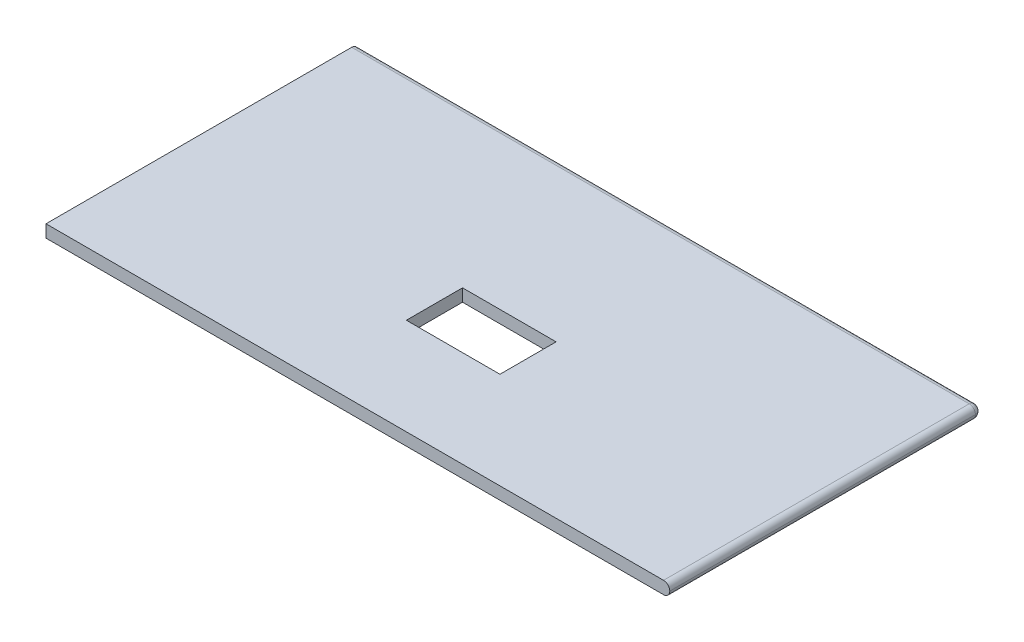
ISO-10303-21;
HEADER;
FILE_DESCRIPTION(('STEP AP214'),'2;1');
FILE_NAME('part.step','',(''),(''),'','','');
FILE_SCHEMA(('AUTOMOTIVE_DESIGN { 1 0 10303 214 1 1 1 1 }'));
ENDSEC;
DATA;
#1=APPLICATION_CONTEXT('core data for automotive mechanical design processes');
#2=APPLICATION_PROTOCOL_DEFINITION('international standard','automotive_design',2000,#1);
#3=PRODUCT_CONTEXT('',#1,'mechanical');
#4=PRODUCT('Part','Part','',(#3));
#5=PRODUCT_RELATED_PRODUCT_CATEGORY('part','',(#4));
#6=PRODUCT_DEFINITION_FORMATION('','',#4);
#7=PRODUCT_DEFINITION_CONTEXT('part definition',#1,'design');
#8=PRODUCT_DEFINITION('design','',#6,#7);
#9=PRODUCT_DEFINITION_SHAPE('','',#8);
#10=(LENGTH_UNIT() NAMED_UNIT(*) SI_UNIT(.MILLI.,.METRE.));
#11=(NAMED_UNIT(*) PLANE_ANGLE_UNIT() SI_UNIT($,.RADIAN.));
#12=(NAMED_UNIT(*) SI_UNIT($,.STERADIAN.) SOLID_ANGLE_UNIT());
#13=UNCERTAINTY_MEASURE_WITH_UNIT(LENGTH_MEASURE(1.E-05),#10,'distance_accuracy_value','');
#14=(GEOMETRIC_REPRESENTATION_CONTEXT(3) GLOBAL_UNCERTAINTY_ASSIGNED_CONTEXT((#13)) GLOBAL_UNIT_ASSIGNED_CONTEXT((#10,
#11,#12)) REPRESENTATION_CONTEXT('',''));
#15=CARTESIAN_POINT('',(0.,0.,0.));
#16=DIRECTION('',(0.,0.,1.));
#17=DIRECTION('',(1.,0.,0.));
#18=AXIS2_PLACEMENT_3D('',#15,#16,#17);
#19=CARTESIAN_POINT('',(-50.,2.,25.));
#20=DIRECTION('',(1.,0.,0.));
#21=DIRECTION('',(0.,0.,-1.));
#22=AXIS2_PLACEMENT_3D('',#19,#20,#21);
#23=PLANE('',#22);
#24=CARTESIAN_POINT('',(-50.,1.,-24.));
#25=DIRECTION('',(1.,0.,0.));
#26=DIRECTION('',(0.,0.,-1.));
#27=AXIS2_PLACEMENT_3D('',#24,#25,#26);
#28=CIRCLE('',#27,1.);
#29=CARTESIAN_POINT('',(-50.,2.,-24.));
#30=VERTEX_POINT('',#29);
#31=CARTESIAN_POINT('',(-50.,1.,-25.));
#32=VERTEX_POINT('',#31);
#33=EDGE_CURVE('E173',#30,#32,#28,.F.);
#34=ORIENTED_EDGE('',*,*,#33,.T.);
#35=CARTESIAN_POINT('',(-50.,1.,-24.));
#36=DIRECTION('',(1.,0.,0.));
#37=DIRECTION('',(0.,0.,-1.));
#38=AXIS2_PLACEMENT_3D('',#35,#36,#37);
#39=CIRCLE('',#38,1.);
#40=CARTESIAN_POINT('',(-50.,0.,-24.));
#41=VERTEX_POINT('',#40);
#42=EDGE_CURVE('E176',#32,#41,#39,.F.);
#43=ORIENTED_EDGE('',*,*,#42,.T.);
#44=DIRECTION('',(0.,0.,1.));
#45=VECTOR('',#44,1.);
#46=CARTESIAN_POINT('',(-50.,0.,25.));
#47=LINE('',#46,#45);
#48=CARTESIAN_POINT('',(-50.,0.,25.));
#49=VERTEX_POINT('',#48);
#50=EDGE_CURVE('E163',#41,#49,#47,.T.);
#51=ORIENTED_EDGE('',*,*,#50,.T.);
#52=DIRECTION('',(0.,-1.,0.));
#53=VECTOR('',#52,1.);
#54=CARTESIAN_POINT('',(-50.,2.,25.));
#55=LINE('',#54,#53);
#56=CARTESIAN_POINT('',(-50.,2.,25.));
#57=VERTEX_POINT('',#56);
#58=EDGE_CURVE('E162',#57,#49,#55,.T.);
#59=ORIENTED_EDGE('',*,*,#58,.F.);
#60=DIRECTION('',(0.,0.,1.));
#61=VECTOR('',#60,1.);
#62=CARTESIAN_POINT('',(-50.,2.,25.));
#63=LINE('',#62,#61);
#64=EDGE_CURVE('E154',#30,#57,#63,.T.);
#65=ORIENTED_EDGE('',*,*,#64,.F.);
#66=EDGE_LOOP('',(#34,#43,#51,#59,#65));
#67=FACE_BOUND('',#66,.T.);
#68=ADVANCED_FACE('F40',(#67),#23,.F.);
#69=CARTESIAN_POINT('',(50.,2.,25.));
#70=DIRECTION('',(0.,0.,-1.));
#71=DIRECTION('',(-1.,0.,0.));
#72=AXIS2_PLACEMENT_3D('',#69,#70,#71);
#73=PLANE('',#72);
#74=DIRECTION('',(1.,0.,0.));
#75=VECTOR('',#74,1.);
#76=CARTESIAN_POINT('',(50.,0.,25.));
#77=LINE('',#76,#75);
#78=CARTESIAN_POINT('',(49.,0.,25.));
#79=VERTEX_POINT('',#78);
#80=EDGE_CURVE('E158',#49,#79,#77,.T.);
#81=ORIENTED_EDGE('',*,*,#80,.T.);
#82=CARTESIAN_POINT('',(49.,1.,25.));
#83=DIRECTION('',(0.,0.,-1.));
#84=DIRECTION('',(-1.,0.,0.));
#85=AXIS2_PLACEMENT_3D('',#82,#83,#84);
#86=CIRCLE('',#85,1.);
#87=CARTESIAN_POINT('',(50.,1.,25.));
#88=VERTEX_POINT('',#87);
#89=EDGE_CURVE('E203',#79,#88,#86,.F.);
#90=ORIENTED_EDGE('',*,*,#89,.T.);
#91=CARTESIAN_POINT('',(49.,1.,25.));
#92=DIRECTION('',(0.,0.,-1.));
#93=DIRECTION('',(-1.,0.,0.));
#94=AXIS2_PLACEMENT_3D('',#91,#92,#93);
#95=CIRCLE('',#94,1.);
#96=CARTESIAN_POINT('',(49.,2.,25.));
#97=VERTEX_POINT('',#96);
#98=EDGE_CURVE('E200',#88,#97,#95,.F.);
#99=ORIENTED_EDGE('',*,*,#98,.T.);
#100=DIRECTION('',(1.,0.,0.));
#101=VECTOR('',#100,1.);
#102=CARTESIAN_POINT('',(50.,2.,25.));
#103=LINE('',#102,#101);
#104=EDGE_CURVE('E157',#57,#97,#103,.T.);
#105=ORIENTED_EDGE('',*,*,#104,.F.);
#106=ORIENTED_EDGE('',*,*,#58,.T.);
#107=EDGE_LOOP('',(#81,#90,#99,#105,#106));
#108=FACE_BOUND('',#107,.T.);
#109=ADVANCED_FACE('F249',(#108),#73,.F.);
#110=CARTESIAN_POINT('',(0.,2.,0.));
#111=DIRECTION('',(0.,1.,0.));
#112=DIRECTION('',(0.,0.,1.));
#113=AXIS2_PLACEMENT_3D('',#110,#111,#112);
#114=PLANE('',#113);
#115=DIRECTION('',(0.,0.,-1.));
#116=VECTOR('',#115,1.);
#117=CARTESIAN_POINT('',(7.27907810343117,2.,0.505960214324788));
#118=LINE('',#117,#116);
#119=CARTESIAN_POINT('',(7.27907810343118,2.,9.50596021432479));
#120=VERTEX_POINT('',#119);
#121=CARTESIAN_POINT('',(7.27907810343117,2.,0.505960214324788));
#122=VERTEX_POINT('',#121);
#123=EDGE_CURVE('E56',#120,#122,#118,.T.);
#124=ORIENTED_EDGE('',*,*,#123,.F.);
#125=DIRECTION('',(1.,0.,0.));
#126=VECTOR('',#125,1.);
#127=CARTESIAN_POINT('',(-7.72092189656882,2.,9.50596021432479));
#128=LINE('',#127,#126);
#129=CARTESIAN_POINT('',(-7.72092189656882,2.,9.50596021432479));
#130=VERTEX_POINT('',#129);
#131=EDGE_CURVE('E139',#130,#120,#128,.T.);
#132=ORIENTED_EDGE('',*,*,#131,.F.);
#133=DIRECTION('',(0.,0.,1.));
#134=VECTOR('',#133,1.);
#135=CARTESIAN_POINT('',(-7.72092189656883,2.,0.50596021432479));
#136=LINE('',#135,#134);
#137=CARTESIAN_POINT('',(-7.72092189656883,2.,0.50596021432479));
#138=VERTEX_POINT('',#137);
#139=EDGE_CURVE('E121',#138,#130,#136,.T.);
#140=ORIENTED_EDGE('',*,*,#139,.F.);
#141=DIRECTION('',(-1.,0.,0.));
#142=VECTOR('',#141,1.);
#143=CARTESIAN_POINT('',(-7.72092189656883,2.,0.50596021432479));
#144=LINE('',#143,#142);
#145=EDGE_CURVE('E131',#122,#138,#144,.T.);
#146=ORIENTED_EDGE('',*,*,#145,.F.);
#147=EDGE_LOOP('',(#124,#132,#140,#146));
#148=FACE_BOUND('',#147,.T.);
#149=ORIENTED_EDGE('',*,*,#104,.T.);
#150=DIRECTION('',(0.,0.,-1.));
#151=VECTOR('',#150,1.);
#152=CARTESIAN_POINT('',(49.,2.,-24.));
#153=LINE('',#152,#151);
#154=CARTESIAN_POINT('',(49.,2.,-24.));
#155=VERTEX_POINT('',#154);
#156=EDGE_CURVE('E206',#97,#155,#153,.T.);
#157=ORIENTED_EDGE('',*,*,#156,.T.);
#158=DIRECTION('',(-1.,0.,0.));
#159=VECTOR('',#158,1.);
#160=CARTESIAN_POINT('',(-50.,2.,-24.));
#161=LINE('',#160,#159);
#162=EDGE_CURVE('E183',#155,#30,#161,.T.);
#163=ORIENTED_EDGE('',*,*,#162,.T.);
#164=ORIENTED_EDGE('',*,*,#64,.T.);
#165=EDGE_LOOP('',(#149,#157,#163,#164));
#166=FACE_BOUND('',#165,.T.);
#167=ADVANCED_FACE('F136',(#148,#166),#114,.T.);
#168=CARTESIAN_POINT('',(0.,0.,0.));
#169=DIRECTION('',(0.,1.,0.));
#170=DIRECTION('',(0.,0.,1.));
#171=AXIS2_PLACEMENT_3D('',#168,#169,#170);
#172=PLANE('',#171);
#173=DIRECTION('',(1.,0.,0.));
#174=VECTOR('',#173,1.);
#175=CARTESIAN_POINT('',(0.,0.,9.50596021432479));
#176=LINE('',#175,#174);
#177=CARTESIAN_POINT('',(-7.72092189656882,0.,9.50596021432479));
#178=VERTEX_POINT('',#177);
#179=CARTESIAN_POINT('',(7.27907810343118,0.,9.50596021432479));
#180=VERTEX_POINT('',#179);
#181=EDGE_CURVE('E49',#178,#180,#176,.T.);
#182=ORIENTED_EDGE('',*,*,#181,.T.);
#183=DIRECTION('',(0.,0.,-1.));
#184=VECTOR('',#183,1.);
#185=CARTESIAN_POINT('',(7.27907810343117,0.,0.));
#186=LINE('',#185,#184);
#187=CARTESIAN_POINT('',(7.27907810343117,0.,0.505960214324788));
#188=VERTEX_POINT('',#187);
#189=EDGE_CURVE('E11',#180,#188,#186,.T.);
#190=ORIENTED_EDGE('',*,*,#189,.T.);
#191=DIRECTION('',(-1.,0.,0.));
#192=VECTOR('',#191,1.);
#193=CARTESIAN_POINT('',(0.,0.,0.505960214324789));
#194=LINE('',#193,#192);
#195=CARTESIAN_POINT('',(-7.72092189656883,0.,0.50596021432479));
#196=VERTEX_POINT('',#195);
#197=EDGE_CURVE('E209',#188,#196,#194,.T.);
#198=ORIENTED_EDGE('',*,*,#197,.T.);
#199=DIRECTION('',(0.,0.,1.));
#200=VECTOR('',#199,1.);
#201=CARTESIAN_POINT('',(-7.72092189656883,0.,0.));
#202=LINE('',#201,#200);
#203=EDGE_CURVE('E124',#196,#178,#202,.T.);
#204=ORIENTED_EDGE('',*,*,#203,.T.);
#205=EDGE_LOOP('',(#182,#190,#198,#204));
#206=FACE_BOUND('',#205,.T.);
#207=DIRECTION('',(-1.,0.,0.));
#208=VECTOR('',#207,1.);
#209=CARTESIAN_POINT('',(0.,0.,-24.));
#210=LINE('',#209,#208);
#211=CARTESIAN_POINT('',(49.,0.,-24.));
#212=VERTEX_POINT('',#211);
#213=EDGE_CURVE('E179',#41,#212,#210,.F.);
#214=ORIENTED_EDGE('',*,*,#213,.T.);
#215=DIRECTION('',(0.,0.,-1.));
#216=VECTOR('',#215,1.);
#217=CARTESIAN_POINT('',(49.,0.,0.));
#218=LINE('',#217,#216);
#219=EDGE_CURVE('E197',#212,#79,#218,.F.);
#220=ORIENTED_EDGE('',*,*,#219,.T.);
#221=ORIENTED_EDGE('',*,*,#80,.F.);
#222=ORIENTED_EDGE('',*,*,#50,.F.);
#223=EDGE_LOOP('',(#214,#220,#221,#222));
#224=FACE_BOUND('',#223,.T.);
#225=ADVANCED_FACE('F229',(#206,#224),#172,.F.);
#226=CARTESIAN_POINT('',(0.,1.,-24.));
#227=DIRECTION('',(1.,0.,0.));
#228=DIRECTION('',(0.,0.,-1.));
#229=AXIS2_PLACEMENT_3D('',#226,#227,#228);
#230=CYLINDRICAL_SURFACE('',#229,1.);
#231=ORIENTED_EDGE('',*,*,#162,.F.);
#232=CARTESIAN_POINT('',(49.,1.,-24.));
#233=DIRECTION('',(1.,0.,0.));
#234=DIRECTION('',(0.,0.,-1.));
#235=AXIS2_PLACEMENT_3D('',#232,#233,#234);
#236=CIRCLE('',#235,1.);
#237=CARTESIAN_POINT('',(49.,1.,-25.));
#238=VERTEX_POINT('',#237);
#239=EDGE_CURVE('E194',#155,#238,#236,.F.);
#240=ORIENTED_EDGE('',*,*,#239,.T.);
#241=DIRECTION('',(-1.,0.,0.));
#242=VECTOR('',#241,1.);
#243=CARTESIAN_POINT('',(50.,1.,-25.));
#244=LINE('',#243,#242);
#245=EDGE_CURVE('E166',#32,#238,#244,.F.);
#246=ORIENTED_EDGE('',*,*,#245,.F.);
#247=ORIENTED_EDGE('',*,*,#33,.F.);
#248=EDGE_LOOP('',(#231,#240,#246,#247));
#249=FACE_BOUND('',#248,.T.);
#250=ADVANCED_FACE('F262',(#249),#230,.T.);
#251=CARTESIAN_POINT('',(50.,1.,-24.));
#252=DIRECTION('',(-1.,0.,0.));
#253=DIRECTION('',(0.,0.,1.));
#254=AXIS2_PLACEMENT_3D('',#251,#252,#253);
#255=CYLINDRICAL_SURFACE('',#254,1.);
#256=ORIENTED_EDGE('',*,*,#245,.T.);
#257=CARTESIAN_POINT('',(49.,1.,-24.));
#258=DIRECTION('',(-1.,0.,0.));
#259=DIRECTION('',(0.,0.,1.));
#260=AXIS2_PLACEMENT_3D('',#257,#258,#259);
#261=CIRCLE('',#260,1.);
#262=EDGE_CURVE('E186',#238,#212,#261,.T.);
#263=ORIENTED_EDGE('',*,*,#262,.T.);
#264=ORIENTED_EDGE('',*,*,#213,.F.);
#265=ORIENTED_EDGE('',*,*,#42,.F.);
#266=EDGE_LOOP('',(#256,#263,#264,#265));
#267=FACE_BOUND('',#266,.T.);
#268=ADVANCED_FACE('F259',(#267),#255,.T.);
#269=CARTESIAN_POINT('',(49.,1.,0.));
#270=DIRECTION('',(0.,0.,1.));
#271=DIRECTION('',(1.,0.,0.));
#272=AXIS2_PLACEMENT_3D('',#269,#270,#271);
#273=CYLINDRICAL_SURFACE('',#272,1.);
#274=ORIENTED_EDGE('',*,*,#156,.F.);
#275=ORIENTED_EDGE('',*,*,#98,.F.);
#276=DIRECTION('',(0.,0.,-1.));
#277=VECTOR('',#276,1.);
#278=CARTESIAN_POINT('',(50.,1.,25.));
#279=LINE('',#278,#277);
#280=CARTESIAN_POINT('',(50.,1.,-24.));
#281=VERTEX_POINT('',#280);
#282=EDGE_CURVE('E190',#281,#88,#279,.F.);
#283=ORIENTED_EDGE('',*,*,#282,.F.);
#284=CARTESIAN_POINT('',(49.,1.,-24.));
#285=DIRECTION('',(0.,0.,-1.));
#286=DIRECTION('',(-1.,0.,0.));
#287=AXIS2_PLACEMENT_3D('',#284,#285,#286);
#288=CIRCLE('',#287,1.);
#289=EDGE_CURVE('E216',#155,#281,#288,.T.);
#290=ORIENTED_EDGE('',*,*,#289,.F.);
#291=EDGE_LOOP('',(#274,#275,#283,#290));
#292=FACE_BOUND('',#291,.T.);
#293=ADVANCED_FACE('F42',(#292),#273,.T.);
#294=CARTESIAN_POINT('',(49.,1.,25.));
#295=DIRECTION('',(0.,0.,-1.));
#296=DIRECTION('',(-1.,0.,0.));
#297=AXIS2_PLACEMENT_3D('',#294,#295,#296);
#298=CYLINDRICAL_SURFACE('',#297,1.);
#299=ORIENTED_EDGE('',*,*,#89,.F.);
#300=ORIENTED_EDGE('',*,*,#219,.F.);
#301=CARTESIAN_POINT('',(49.,1.,-24.));
#302=DIRECTION('',(0.,0.,-1.));
#303=DIRECTION('',(-1.,0.,0.));
#304=AXIS2_PLACEMENT_3D('',#301,#302,#303);
#305=CIRCLE('',#304,1.);
#306=EDGE_CURVE('E213',#281,#212,#305,.T.);
#307=ORIENTED_EDGE('',*,*,#306,.F.);
#308=ORIENTED_EDGE('',*,*,#282,.T.);
#309=EDGE_LOOP('',(#299,#300,#307,#308));
#310=FACE_BOUND('',#309,.T.);
#311=ADVANCED_FACE('F268',(#310),#298,.T.);
#312=CARTESIAN_POINT('',(49.,1.,-24.));
#313=DIRECTION('',(-1.,0.,0.));
#314=DIRECTION('',(0.,0.,1.));
#315=AXIS2_PLACEMENT_3D('',#312,#313,#314);
#316=SPHERICAL_SURFACE('',#315,1.);
#317=ORIENTED_EDGE('',*,*,#239,.F.);
#318=ORIENTED_EDGE('',*,*,#289,.T.);
#319=CARTESIAN_POINT('',(49.,1.,-24.));
#320=DIRECTION('',(0.,-1.,0.));
#321=DIRECTION('',(0.,0.,-1.));
#322=AXIS2_PLACEMENT_3D('',#319,#320,#321);
#323=CIRCLE('',#322,1.);
#324=EDGE_CURVE('E149',#238,#281,#323,.T.);
#325=ORIENTED_EDGE('',*,*,#324,.F.);
#326=EDGE_LOOP('',(#317,#318,#325));
#327=FACE_BOUND('',#326,.T.);
#328=ADVANCED_FACE('F243',(#327),#316,.T.);
#329=CARTESIAN_POINT('',(49.,1.,-24.));
#330=DIRECTION('',(-1.,0.,0.));
#331=DIRECTION('',(0.,0.,1.));
#332=AXIS2_PLACEMENT_3D('',#329,#330,#331);
#333=SPHERICAL_SURFACE('',#332,1.);
#334=ORIENTED_EDGE('',*,*,#306,.T.);
#335=ORIENTED_EDGE('',*,*,#262,.F.);
#336=ORIENTED_EDGE('',*,*,#324,.T.);
#337=EDGE_LOOP('',(#334,#335,#336));
#338=FACE_BOUND('',#337,.T.);
#339=ADVANCED_FACE('F236',(#338),#333,.T.);
#340=CARTESIAN_POINT('',(7.27907810343117,-8.,0.505960214324788));
#341=DIRECTION('',(1.,0.,0.));
#342=DIRECTION('',(0.,0.,-1.));
#343=AXIS2_PLACEMENT_3D('',#340,#341,#342);
#344=PLANE('',#343);
#345=DIRECTION('',(0.,1.,0.));
#346=VECTOR('',#345,1.);
#347=CARTESIAN_POINT('',(7.27907810343118,-8.,9.50596021432479));
#348=LINE('',#347,#346);
#349=EDGE_CURVE('E146',#180,#120,#348,.T.);
#350=ORIENTED_EDGE('',*,*,#349,.T.);
#351=ORIENTED_EDGE('',*,*,#123,.T.);
#352=DIRECTION('',(0.,1.,0.));
#353=VECTOR('',#352,1.);
#354=CARTESIAN_POINT('',(7.27907810343117,-8.,0.505960214324788));
#355=LINE('',#354,#353);
#356=EDGE_CURVE('E128',#188,#122,#355,.T.);
#357=ORIENTED_EDGE('',*,*,#356,.F.);
#358=ORIENTED_EDGE('',*,*,#189,.F.);
#359=EDGE_LOOP('',(#350,#351,#357,#358));
#360=FACE_BOUND('',#359,.T.);
#361=ADVANCED_FACE('F234',(#360),#344,.F.);
#362=CARTESIAN_POINT('',(-7.72092189656882,-8.,9.50596021432479));
#363=DIRECTION('',(0.,0.,1.));
#364=DIRECTION('',(1.,0.,0.));
#365=AXIS2_PLACEMENT_3D('',#362,#363,#364);
#366=PLANE('',#365);
#367=DIRECTION('',(0.,1.,0.));
#368=VECTOR('',#367,1.);
#369=CARTESIAN_POINT('',(-7.72092189656882,-8.,9.50596021432479));
#370=LINE('',#369,#368);
#371=EDGE_CURVE('E127',#178,#130,#370,.T.);
#372=ORIENTED_EDGE('',*,*,#371,.T.);
#373=ORIENTED_EDGE('',*,*,#131,.T.);
#374=ORIENTED_EDGE('',*,*,#349,.F.);
#375=ORIENTED_EDGE('',*,*,#181,.F.);
#376=EDGE_LOOP('',(#372,#373,#374,#375));
#377=FACE_BOUND('',#376,.T.);
#378=ADVANCED_FACE('F233',(#377),#366,.F.);
#379=CARTESIAN_POINT('',(-7.72092189656883,-8.,0.50596021432479));
#380=DIRECTION('',(-1.,0.,0.));
#381=DIRECTION('',(0.,0.,1.));
#382=AXIS2_PLACEMENT_3D('',#379,#380,#381);
#383=PLANE('',#382);
#384=DIRECTION('',(0.,1.,0.));
#385=VECTOR('',#384,1.);
#386=CARTESIAN_POINT('',(-7.72092189656883,-8.,0.50596021432479));
#387=LINE('',#386,#385);
#388=EDGE_CURVE('E64',#196,#138,#387,.T.);
#389=ORIENTED_EDGE('',*,*,#388,.T.);
#390=ORIENTED_EDGE('',*,*,#139,.T.);
#391=ORIENTED_EDGE('',*,*,#371,.F.);
#392=ORIENTED_EDGE('',*,*,#203,.F.);
#393=EDGE_LOOP('',(#389,#390,#391,#392));
#394=FACE_BOUND('',#393,.T.);
#395=ADVANCED_FACE('F118',(#394),#383,.F.);
#396=CARTESIAN_POINT('',(-7.72092189656883,-8.,0.50596021432479));
#397=DIRECTION('',(0.,0.,-1.));
#398=DIRECTION('',(-1.,0.,0.));
#399=AXIS2_PLACEMENT_3D('',#396,#397,#398);
#400=PLANE('',#399);
#401=ORIENTED_EDGE('',*,*,#356,.T.);
#402=ORIENTED_EDGE('',*,*,#145,.T.);
#403=ORIENTED_EDGE('',*,*,#388,.F.);
#404=ORIENTED_EDGE('',*,*,#197,.F.);
#405=EDGE_LOOP('',(#401,#402,#403,#404));
#406=FACE_BOUND('',#405,.T.);
#407=ADVANCED_FACE('F132',(#406),#400,.F.);
#408=CLOSED_SHELL('',(#68,#109,#167,#225,#250,#268,#293,#311,#328,#339,#361,#378,#395,#407));
#409=MANIFOLD_SOLID_BREP('B2',#408);
#410=ADVANCED_BREP_SHAPE_REPRESENTATION('',(#18,#409),#14);
#411=SHAPE_DEFINITION_REPRESENTATION(#9,#410);
ENDSEC;
END-ISO-10303-21;
